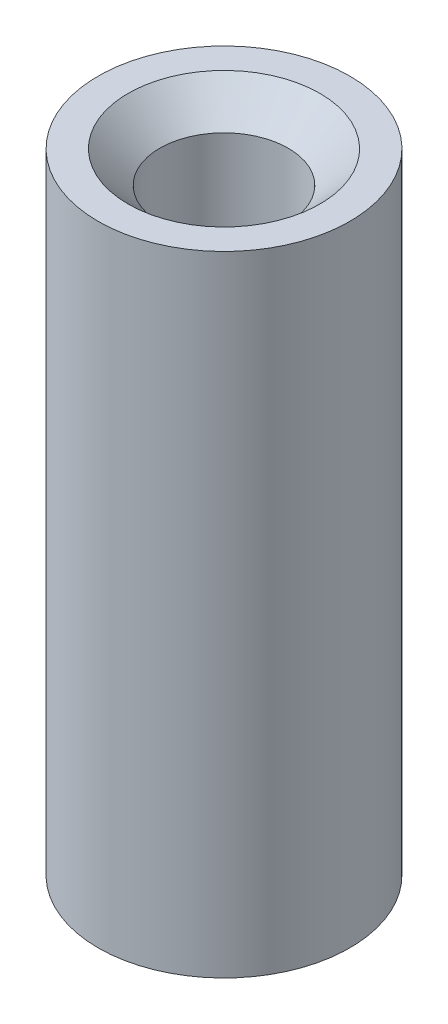
ISO-10303-21;
HEADER;
FILE_DESCRIPTION(('STEP AP214'),'2;1');
FILE_NAME('part.step','',(''),(''),'','','');
FILE_SCHEMA(('AUTOMOTIVE_DESIGN { 1 0 10303 214 1 1 1 1 }'));
ENDSEC;
DATA;
#1=APPLICATION_CONTEXT('core data for automotive mechanical design processes');
#2=APPLICATION_PROTOCOL_DEFINITION('international standard','automotive_design',2000,#1);
#3=PRODUCT_CONTEXT('',#1,'mechanical');
#4=PRODUCT('Part','Part','',(#3));
#5=PRODUCT_RELATED_PRODUCT_CATEGORY('part','',(#4));
#6=PRODUCT_DEFINITION_FORMATION('','',#4);
#7=PRODUCT_DEFINITION_CONTEXT('part definition',#1,'design');
#8=PRODUCT_DEFINITION('design','',#6,#7);
#9=PRODUCT_DEFINITION_SHAPE('','',#8);
#10=(LENGTH_UNIT() NAMED_UNIT(*) SI_UNIT(.MILLI.,.METRE.));
#11=(NAMED_UNIT(*) PLANE_ANGLE_UNIT() SI_UNIT($,.RADIAN.));
#12=(NAMED_UNIT(*) SI_UNIT($,.STERADIAN.) SOLID_ANGLE_UNIT());
#13=UNCERTAINTY_MEASURE_WITH_UNIT(LENGTH_MEASURE(1.E-05),#10,'distance_accuracy_value','');
#14=(GEOMETRIC_REPRESENTATION_CONTEXT(3) GLOBAL_UNCERTAINTY_ASSIGNED_CONTEXT((#13)) GLOBAL_UNIT_ASSIGNED_CONTEXT((#10,
#11,#12)) REPRESENTATION_CONTEXT('',''));
#15=CARTESIAN_POINT('',(0.,0.,0.));
#16=DIRECTION('',(0.,0.,1.));
#17=DIRECTION('',(1.,0.,0.));
#18=AXIS2_PLACEMENT_3D('',#15,#16,#17);
#19=CARTESIAN_POINT('',(0.,-25.,0.));
#20=DIRECTION('',(0.,1.,0.));
#21=DIRECTION('',(0.,0.,1.));
#22=AXIS2_PLACEMENT_3D('',#19,#20,#21);
#23=CYLINDRICAL_SURFACE('',#22,5.);
#24=CARTESIAN_POINT('',(0.,-25.,0.));
#25=DIRECTION('',(0.,1.,0.));
#26=DIRECTION('',(0.,0.,1.));
#27=AXIS2_PLACEMENT_3D('',#24,#25,#26);
#28=CIRCLE('',#27,5.);
#29=CARTESIAN_POINT('',(0.,-25.,5.));
#30=VERTEX_POINT('',#29);
#31=EDGE_CURVE('E10',#30,#30,#28,.T.);
#32=ORIENTED_EDGE('',*,*,#31,.T.);
#33=EDGE_LOOP('',(#32));
#34=FACE_BOUND('',#33,.T.);
#35=CARTESIAN_POINT('',(0.,0.,0.));
#36=DIRECTION('',(0.,1.,0.));
#37=DIRECTION('',(0.,0.,1.));
#38=AXIS2_PLACEMENT_3D('',#35,#36,#37);
#39=CIRCLE('',#38,5.);
#40=CARTESIAN_POINT('',(0.,0.,5.));
#41=VERTEX_POINT('',#40);
#42=EDGE_CURVE('E42',#41,#41,#39,.T.);
#43=ORIENTED_EDGE('',*,*,#42,.F.);
#44=EDGE_LOOP('',(#43));
#45=FACE_BOUND('',#44,.T.);
#46=ADVANCED_FACE('F39',(#34,#45),#23,.T.);
#47=CARTESIAN_POINT('',(0.,-25.,0.));
#48=DIRECTION('',(0.,1.,0.));
#49=DIRECTION('',(0.,0.,1.));
#50=AXIS2_PLACEMENT_3D('',#47,#48,#49);
#51=PLANE('',#50);
#52=CARTESIAN_POINT('',(0.,-25.,0.));
#53=DIRECTION('',(0.,1.,0.));
#54=DIRECTION('',(0.,0.,1.));
#55=AXIS2_PLACEMENT_3D('',#52,#53,#54);
#56=CIRCLE('',#55,2.55269999999992);
#57=CARTESIAN_POINT('',(0.,-25.,2.55269999999992));
#58=VERTEX_POINT('',#57);
#59=EDGE_CURVE('E49',#58,#58,#56,.T.);
#60=ORIENTED_EDGE('',*,*,#59,.T.);
#61=EDGE_LOOP('',(#60));
#62=FACE_BOUND('',#61,.T.);
#63=ORIENTED_EDGE('',*,*,#31,.F.);
#64=EDGE_LOOP('',(#63));
#65=FACE_BOUND('',#64,.T.);
#66=ADVANCED_FACE('F66',(#62,#65),#51,.F.);
#67=CARTESIAN_POINT('',(0.,0.,0.));
#68=DIRECTION('',(0.,1.,0.));
#69=DIRECTION('',(0.,0.,1.));
#70=AXIS2_PLACEMENT_3D('',#67,#68,#69);
#71=PLANE('',#70);
#72=CARTESIAN_POINT('',(0.,0.,0.));
#73=DIRECTION('',(0.,1.,0.));
#74=DIRECTION('',(0.,0.,1.));
#75=AXIS2_PLACEMENT_3D('',#72,#73,#74);
#76=CIRCLE('',#75,3.81);
#77=CARTESIAN_POINT('',(0.,0.,3.81));
#78=VERTEX_POINT('',#77);
#79=EDGE_CURVE('E56',#78,#78,#76,.T.);
#80=ORIENTED_EDGE('',*,*,#79,.F.);
#81=EDGE_LOOP('',(#80));
#82=FACE_BOUND('',#81,.T.);
#83=ORIENTED_EDGE('',*,*,#42,.T.);
#84=EDGE_LOOP('',(#83));
#85=FACE_BOUND('',#84,.T.);
#86=ADVANCED_FACE('F62',(#82,#85),#71,.T.);
#87=CARTESIAN_POINT('',(0.,0.,0.));
#88=DIRECTION('',(0.,1.,0.));
#89=DIRECTION('',(0.,0.,1.));
#90=AXIS2_PLACEMENT_3D('',#87,#88,#89);
#91=CYLINDRICAL_SURFACE('',#90,2.55269999999996);
#92=ORIENTED_EDGE('',*,*,#59,.F.);
#93=EDGE_LOOP('',(#92));
#94=FACE_BOUND('',#93,.T.);
#95=CARTESIAN_POINT('',(0.,-1.2573,0.));
#96=DIRECTION('',(0.,1.,0.));
#97=DIRECTION('',(0.,0.,1.));
#98=AXIS2_PLACEMENT_3D('',#95,#96,#97);
#99=CIRCLE('',#98,2.5527);
#100=CARTESIAN_POINT('',(0.,-1.2573,2.5527));
#101=VERTEX_POINT('',#100);
#102=EDGE_CURVE('E53',#101,#101,#99,.T.);
#103=ORIENTED_EDGE('',*,*,#102,.T.);
#104=EDGE_LOOP('',(#103));
#105=FACE_BOUND('',#104,.T.);
#106=ADVANCED_FACE('F65',(#94,#105),#91,.F.);
#107=CARTESIAN_POINT('',(0.,0.,0.));
#108=DIRECTION('',(0.,1.,0.));
#109=DIRECTION('',(0.,0.,1.));
#110=AXIS2_PLACEMENT_3D('',#107,#108,#109);
#111=CONICAL_SURFACE('',#110,3.81,0.785398163397449);
#112=ORIENTED_EDGE('',*,*,#102,.F.);
#113=EDGE_LOOP('',(#112));
#114=FACE_BOUND('',#113,.T.);
#115=ORIENTED_EDGE('',*,*,#79,.T.);
#116=EDGE_LOOP('',(#115));
#117=FACE_BOUND('',#116,.T.);
#118=ADVANCED_FACE('F60',(#114,#117),#111,.F.);
#119=CLOSED_SHELL('',(#46,#66,#86,#106,#118));
#120=MANIFOLD_SOLID_BREP('B2',#119);
#121=ADVANCED_BREP_SHAPE_REPRESENTATION('',(#18,#120),#14);
#122=SHAPE_DEFINITION_REPRESENTATION(#9,#121);
ENDSEC;
END-ISO-10303-21;
